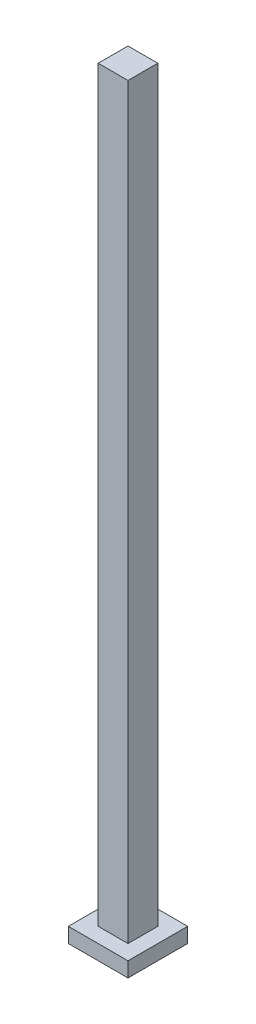
ISO-10303-21;
HEADER;
FILE_DESCRIPTION(('STEP AP214'),'2;1');
FILE_NAME('part.step','',(''),(''),'','','');
FILE_SCHEMA(('AUTOMOTIVE_DESIGN { 1 0 10303 214 1 1 1 1 }'));
ENDSEC;
DATA;
#1=APPLICATION_CONTEXT('core data for automotive mechanical design processes');
#2=APPLICATION_PROTOCOL_DEFINITION('international standard','automotive_design',2000,#1);
#3=PRODUCT_CONTEXT('',#1,'mechanical');
#4=PRODUCT('Part','Part','',(#3));
#5=PRODUCT_RELATED_PRODUCT_CATEGORY('part','',(#4));
#6=PRODUCT_DEFINITION_FORMATION('','',#4);
#7=PRODUCT_DEFINITION_CONTEXT('part definition',#1,'design');
#8=PRODUCT_DEFINITION('design','',#6,#7);
#9=PRODUCT_DEFINITION_SHAPE('','',#8);
#10=(LENGTH_UNIT() NAMED_UNIT(*) SI_UNIT(.MILLI.,.METRE.));
#11=(NAMED_UNIT(*) PLANE_ANGLE_UNIT() SI_UNIT($,.RADIAN.));
#12=(NAMED_UNIT(*) SI_UNIT($,.STERADIAN.) SOLID_ANGLE_UNIT());
#13=UNCERTAINTY_MEASURE_WITH_UNIT(LENGTH_MEASURE(1.E-05),#10,'distance_accuracy_value','');
#14=(GEOMETRIC_REPRESENTATION_CONTEXT(3) GLOBAL_UNCERTAINTY_ASSIGNED_CONTEXT((#13)) GLOBAL_UNIT_ASSIGNED_CONTEXT((#10,
#11,#12)) REPRESENTATION_CONTEXT('',''));
#15=CARTESIAN_POINT('',(0.,0.,0.));
#16=DIRECTION('',(0.,0.,1.));
#17=DIRECTION('',(1.,0.,0.));
#18=AXIS2_PLACEMENT_3D('',#15,#16,#17);
#19=CARTESIAN_POINT('',(100.,50.,100.));
#20=DIRECTION('',(0.,-1.,0.));
#21=DIRECTION('',(1.,0.,0.));
#22=AXIS2_PLACEMENT_3D('',#19,#20,#21);
#23=PLANE('',#22);
#24=DIRECTION('',(-1.,0.,0.));
#25=VECTOR('',#24,1.);
#26=CARTESIAN_POINT('',(100.,50.,-100.));
#27=LINE('',#26,#25);
#28=CARTESIAN_POINT('',(100.,50.,-100.));
#29=VERTEX_POINT('',#28);
#30=CARTESIAN_POINT('',(-100.,50.,-100.));
#31=VERTEX_POINT('',#30);
#32=EDGE_CURVE('E245',#29,#31,#27,.T.);
#33=ORIENTED_EDGE('',*,*,#32,.T.);
#34=DIRECTION('',(0.,0.,-1.));
#35=VECTOR('',#34,1.);
#36=CARTESIAN_POINT('',(-100.,50.,100.));
#37=LINE('',#36,#35);
#38=CARTESIAN_POINT('',(-100.,50.,100.));
#39=VERTEX_POINT('',#38);
#40=EDGE_CURVE('E253',#39,#31,#37,.T.);
#41=ORIENTED_EDGE('',*,*,#40,.F.);
#42=DIRECTION('',(-1.,0.,0.));
#43=VECTOR('',#42,1.);
#44=CARTESIAN_POINT('',(100.,50.,100.));
#45=LINE('',#44,#43);
#46=CARTESIAN_POINT('',(100.,50.,100.));
#47=VERTEX_POINT('',#46);
#48=EDGE_CURVE('E234',#47,#39,#45,.T.);
#49=ORIENTED_EDGE('',*,*,#48,.F.);
#50=DIRECTION('',(0.,0.,-1.));
#51=VECTOR('',#50,1.);
#52=CARTESIAN_POINT('',(100.,50.,100.));
#53=LINE('',#52,#51);
#54=EDGE_CURVE('E49',#47,#29,#53,.T.);
#55=ORIENTED_EDGE('',*,*,#54,.T.);
#56=EDGE_LOOP('',(#33,#41,#49,#55));
#57=FACE_BOUND('',#56,.T.);
#58=DIRECTION('',(0.,0.,1.));
#59=VECTOR('',#58,1.);
#60=CARTESIAN_POINT('',(-50.,50.,-50.));
#61=LINE('',#60,#59);
#62=CARTESIAN_POINT('',(-50.,50.,-50.));
#63=VERTEX_POINT('',#62);
#64=CARTESIAN_POINT('',(-50.0000000000003,50.,50.));
#65=VERTEX_POINT('',#64);
#66=EDGE_CURVE('E135',#63,#65,#61,.T.);
#67=ORIENTED_EDGE('',*,*,#66,.F.);
#68=DIRECTION('',(-1.,0.,0.));
#69=VECTOR('',#68,1.);
#70=CARTESIAN_POINT('',(-50.,50.,-50.));
#71=LINE('',#70,#69);
#72=CARTESIAN_POINT('',(50.,50.,-50.));
#73=VERTEX_POINT('',#72);
#74=EDGE_CURVE('E214',#73,#63,#71,.T.);
#75=ORIENTED_EDGE('',*,*,#74,.F.);
#76=DIRECTION('',(0.,0.,-1.));
#77=VECTOR('',#76,1.);
#78=CARTESIAN_POINT('',(50.,50.,-50.));
#79=LINE('',#78,#77);
#80=CARTESIAN_POINT('',(50.,50.,50.));
#81=VERTEX_POINT('',#80);
#82=EDGE_CURVE('E61',#81,#73,#79,.T.);
#83=ORIENTED_EDGE('',*,*,#82,.F.);
#84=DIRECTION('',(1.,0.,0.));
#85=VECTOR('',#84,1.);
#86=CARTESIAN_POINT('',(-50.,50.,50.));
#87=LINE('',#86,#85);
#88=EDGE_CURVE('E56',#65,#81,#87,.T.);
#89=ORIENTED_EDGE('',*,*,#88,.F.);
#90=EDGE_LOOP('',(#67,#75,#83,#89));
#91=FACE_BOUND('',#90,.T.);
#92=ADVANCED_FACE('F39',(#57,#91),#23,.F.);
#93=CARTESIAN_POINT('',(0.,0.,100.));
#94=DIRECTION('',(0.,1.,0.));
#95=DIRECTION('',(0.,0.,1.));
#96=AXIS2_PLACEMENT_3D('',#93,#94,#95);
#97=PLANE('',#96);
#98=DIRECTION('',(1.,0.,0.));
#99=VECTOR('',#98,1.);
#100=CARTESIAN_POINT('',(0.,0.,-100.));
#101=LINE('',#100,#99);
#102=CARTESIAN_POINT('',(-100.,0.,-100.));
#103=VERTEX_POINT('',#102);
#104=CARTESIAN_POINT('',(100.,0.,-100.));
#105=VERTEX_POINT('',#104);
#106=EDGE_CURVE('E138',#103,#105,#101,.T.);
#107=ORIENTED_EDGE('',*,*,#106,.T.);
#108=DIRECTION('',(0.,0.,-1.));
#109=VECTOR('',#108,1.);
#110=CARTESIAN_POINT('',(100.,0.,100.));
#111=LINE('',#110,#109);
#112=CARTESIAN_POINT('',(100.,0.,100.));
#113=VERTEX_POINT('',#112);
#114=EDGE_CURVE('E11',#113,#105,#111,.T.);
#115=ORIENTED_EDGE('',*,*,#114,.F.);
#116=DIRECTION('',(1.,0.,0.));
#117=VECTOR('',#116,1.);
#118=CARTESIAN_POINT('',(-100.,0.,100.));
#119=LINE('',#118,#117);
#120=CARTESIAN_POINT('',(-100.,0.,100.));
#121=VERTEX_POINT('',#120);
#122=EDGE_CURVE('E227',#121,#113,#119,.T.);
#123=ORIENTED_EDGE('',*,*,#122,.F.);
#124=DIRECTION('',(0.,0.,-1.));
#125=VECTOR('',#124,1.);
#126=CARTESIAN_POINT('',(-100.,0.,100.));
#127=LINE('',#126,#125);
#128=EDGE_CURVE('E240',#121,#103,#127,.T.);
#129=ORIENTED_EDGE('',*,*,#128,.T.);
#130=EDGE_LOOP('',(#107,#115,#123,#129));
#131=FACE_BOUND('',#130,.T.);
#132=ADVANCED_FACE('F41',(#131),#97,.F.);
#133=CARTESIAN_POINT('',(100.,0.,100.));
#134=DIRECTION('',(-1.,0.,0.));
#135=DIRECTION('',(0.,0.,1.));
#136=AXIS2_PLACEMENT_3D('',#133,#134,#135);
#137=PLANE('',#136);
#138=DIRECTION('',(0.,1.,0.));
#139=VECTOR('',#138,1.);
#140=CARTESIAN_POINT('',(100.,0.,-100.));
#141=LINE('',#140,#139);
#142=EDGE_CURVE('E243',#105,#29,#141,.T.);
#143=ORIENTED_EDGE('',*,*,#142,.T.);
#144=ORIENTED_EDGE('',*,*,#54,.F.);
#145=DIRECTION('',(0.,1.,0.));
#146=VECTOR('',#145,1.);
#147=CARTESIAN_POINT('',(100.,0.,100.));
#148=LINE('',#147,#146);
#149=EDGE_CURVE('E230',#113,#47,#148,.T.);
#150=ORIENTED_EDGE('',*,*,#149,.F.);
#151=ORIENTED_EDGE('',*,*,#114,.T.);
#152=EDGE_LOOP('',(#143,#144,#150,#151));
#153=FACE_BOUND('',#152,.T.);
#154=ADVANCED_FACE('F278',(#153),#137,.F.);
#155=CARTESIAN_POINT('',(-100.,50.,100.));
#156=DIRECTION('',(1.,0.,0.));
#157=DIRECTION('',(0.,0.,-1.));
#158=AXIS2_PLACEMENT_3D('',#155,#156,#157);
#159=PLANE('',#158);
#160=DIRECTION('',(0.,-1.,0.));
#161=VECTOR('',#160,1.);
#162=CARTESIAN_POINT('',(-100.,50.,-100.));
#163=LINE('',#162,#161);
#164=EDGE_CURVE('E231',#31,#103,#163,.T.);
#165=ORIENTED_EDGE('',*,*,#164,.T.);
#166=ORIENTED_EDGE('',*,*,#128,.F.);
#167=DIRECTION('',(0.,-1.,0.));
#168=VECTOR('',#167,1.);
#169=CARTESIAN_POINT('',(-100.,50.,100.));
#170=LINE('',#169,#168);
#171=EDGE_CURVE('E237',#39,#121,#170,.T.);
#172=ORIENTED_EDGE('',*,*,#171,.F.);
#173=ORIENTED_EDGE('',*,*,#40,.T.);
#174=EDGE_LOOP('',(#165,#166,#172,#173));
#175=FACE_BOUND('',#174,.T.);
#176=ADVANCED_FACE('F271',(#175),#159,.F.);
#177=CARTESIAN_POINT('',(0.,0.,100.));
#178=DIRECTION('',(0.,0.,1.));
#179=DIRECTION('',(1.,0.,0.));
#180=AXIS2_PLACEMENT_3D('',#177,#178,#179);
#181=PLANE('',#180);
#182=ORIENTED_EDGE('',*,*,#122,.T.);
#183=ORIENTED_EDGE('',*,*,#149,.T.);
#184=ORIENTED_EDGE('',*,*,#48,.T.);
#185=ORIENTED_EDGE('',*,*,#171,.T.);
#186=EDGE_LOOP('',(#182,#183,#184,#185));
#187=FACE_BOUND('',#186,.T.);
#188=ADVANCED_FACE('F277',(#187),#181,.T.);
#189=CARTESIAN_POINT('',(0.,0.,-100.));
#190=DIRECTION('',(0.,0.,1.));
#191=DIRECTION('',(1.,0.,0.));
#192=AXIS2_PLACEMENT_3D('',#189,#190,#191);
#193=PLANE('',#192);
#194=ORIENTED_EDGE('',*,*,#106,.F.);
#195=ORIENTED_EDGE('',*,*,#164,.F.);
#196=ORIENTED_EDGE('',*,*,#32,.F.);
#197=ORIENTED_EDGE('',*,*,#142,.F.);
#198=EDGE_LOOP('',(#194,#195,#196,#197));
#199=FACE_BOUND('',#198,.T.);
#200=ADVANCED_FACE('F268',(#199),#193,.F.);
#201=CARTESIAN_POINT('',(-50.0000000000004,2550.,-50.));
#202=DIRECTION('',(1.,0.,0.));
#203=DIRECTION('',(0.,1.,0.));
#204=AXIS2_PLACEMENT_3D('',#201,#202,#203);
#205=PLANE('',#204);
#206=ORIENTED_EDGE('',*,*,#66,.T.);
#207=DIRECTION('',(0.,-1.,0.));
#208=VECTOR('',#207,1.);
#209=CARTESIAN_POINT('',(-50.0000000000004,2550.,50.));
#210=LINE('',#209,#208);
#211=CARTESIAN_POINT('',(-50.0000000000004,2555.,50.));
#212=VERTEX_POINT('',#211);
#213=EDGE_CURVE('E128',#212,#65,#210,.T.);
#214=ORIENTED_EDGE('',*,*,#213,.F.);
#215=DIRECTION('',(0.,0.,1.));
#216=VECTOR('',#215,1.);
#217=CARTESIAN_POINT('',(-50.0000000000004,2555.,-50.));
#218=LINE('',#217,#216);
#219=CARTESIAN_POINT('',(-50.0000000000004,2555.,-50.));
#220=VERTEX_POINT('',#219);
#221=EDGE_CURVE('E133',#220,#212,#218,.T.);
#222=ORIENTED_EDGE('',*,*,#221,.F.);
#223=DIRECTION('',(0.,-1.,0.));
#224=VECTOR('',#223,1.);
#225=CARTESIAN_POINT('',(-50.0000000000004,2550.,-50.));
#226=LINE('',#225,#224);
#227=EDGE_CURVE('E218',#220,#63,#226,.T.);
#228=ORIENTED_EDGE('',*,*,#227,.T.);
#229=EDGE_LOOP('',(#206,#214,#222,#228));
#230=FACE_BOUND('',#229,.T.);
#231=ADVANCED_FACE('F130',(#230),#205,.F.);
#232=CARTESIAN_POINT('',(-50.0000000000004,2550.,50.));
#233=DIRECTION('',(0.,0.,-1.));
#234=DIRECTION('',(-1.,0.,0.));
#235=AXIS2_PLACEMENT_3D('',#232,#233,#234);
#236=PLANE('',#235);
#237=ORIENTED_EDGE('',*,*,#88,.T.);
#238=DIRECTION('',(0.,-1.,0.));
#239=VECTOR('',#238,1.);
#240=CARTESIAN_POINT('',(49.9999999999997,2550.,50.));
#241=LINE('',#240,#239);
#242=CARTESIAN_POINT('',(49.9999999999997,2555.,50.));
#243=VERTEX_POINT('',#242);
#244=EDGE_CURVE('E139',#243,#81,#241,.T.);
#245=ORIENTED_EDGE('',*,*,#244,.F.);
#246=DIRECTION('',(1.,0.,0.));
#247=VECTOR('',#246,1.);
#248=CARTESIAN_POINT('',(-50.0000000000004,2555.,50.));
#249=LINE('',#248,#247);
#250=EDGE_CURVE('E142',#212,#243,#249,.T.);
#251=ORIENTED_EDGE('',*,*,#250,.F.);
#252=ORIENTED_EDGE('',*,*,#213,.T.);
#253=EDGE_LOOP('',(#237,#245,#251,#252));
#254=FACE_BOUND('',#253,.T.);
#255=ADVANCED_FACE('F143',(#254),#236,.F.);
#256=CARTESIAN_POINT('',(49.9999999999996,2550.,-50.));
#257=DIRECTION('',(-1.,0.,0.));
#258=DIRECTION('',(0.,0.,1.));
#259=AXIS2_PLACEMENT_3D('',#256,#257,#258);
#260=PLANE('',#259);
#261=ORIENTED_EDGE('',*,*,#82,.T.);
#262=DIRECTION('',(0.,-1.,0.));
#263=VECTOR('',#262,1.);
#264=CARTESIAN_POINT('',(49.9999999999996,2550.,-50.));
#265=LINE('',#264,#263);
#266=CARTESIAN_POINT('',(49.9999999999997,2555.,-50.));
#267=VERTEX_POINT('',#266);
#268=EDGE_CURVE('E221',#267,#73,#265,.T.);
#269=ORIENTED_EDGE('',*,*,#268,.F.);
#270=DIRECTION('',(0.,0.,1.));
#271=VECTOR('',#270,1.);
#272=CARTESIAN_POINT('',(49.9999999999997,2555.,-50.));
#273=LINE('',#272,#271);
#274=EDGE_CURVE('E149',#267,#243,#273,.T.);
#275=ORIENTED_EDGE('',*,*,#274,.T.);
#276=ORIENTED_EDGE('',*,*,#244,.T.);
#277=EDGE_LOOP('',(#261,#269,#275,#276));
#278=FACE_BOUND('',#277,.T.);
#279=ADVANCED_FACE('F330',(#278),#260,.F.);
#280=CARTESIAN_POINT('',(-50.0000000000004,2550.,-50.));
#281=DIRECTION('',(0.,0.,1.));
#282=DIRECTION('',(1.,0.,0.));
#283=AXIS2_PLACEMENT_3D('',#280,#281,#282);
#284=PLANE('',#283);
#285=ORIENTED_EDGE('',*,*,#74,.T.);
#286=ORIENTED_EDGE('',*,*,#227,.F.);
#287=DIRECTION('',(1.,0.,0.));
#288=VECTOR('',#287,1.);
#289=CARTESIAN_POINT('',(-50.0000000000004,2555.,-50.));
#290=LINE('',#289,#288);
#291=EDGE_CURVE('E153',#220,#267,#290,.T.);
#292=ORIENTED_EDGE('',*,*,#291,.T.);
#293=ORIENTED_EDGE('',*,*,#268,.T.);
#294=EDGE_LOOP('',(#285,#286,#292,#293));
#295=FACE_BOUND('',#294,.T.);
#296=ADVANCED_FACE('F327',(#295),#284,.F.);
#297=CARTESIAN_POINT('',(0.,2555.,0.));
#298=DIRECTION('',(0.,1.,0.));
#299=DIRECTION('',(0.,0.,1.));
#300=AXIS2_PLACEMENT_3D('',#297,#298,#299);
#301=PLANE('',#300);
#302=ORIENTED_EDGE('',*,*,#221,.T.);
#303=ORIENTED_EDGE('',*,*,#250,.T.);
#304=ORIENTED_EDGE('',*,*,#274,.F.);
#305=ORIENTED_EDGE('',*,*,#291,.F.);
#306=EDGE_LOOP('',(#302,#303,#304,#305));
#307=FACE_BOUND('',#306,.T.);
#308=ADVANCED_FACE('F151',(#307),#301,.T.);
#309=CLOSED_SHELL('',(#92,#132,#154,#176,#188,#200,#231,#255,#279,#296,#308));
#310=DIRECTION('',(-1.,0.,0.));
#311=VECTOR('',#310,1.);
#312=CARTESIAN_POINT('',(-45.2726750226584,50.,-44.5989745014881));
#313=LINE('',#312,#311);
#314=CARTESIAN_POINT('',(44.7273249773416,50.,-44.5989745014881));
#315=VERTEX_POINT('',#314);
#316=CARTESIAN_POINT('',(-45.2726750226588,50.,-44.5989745014881));
#317=VERTEX_POINT('',#316);
#318=EDGE_CURVE('E169',#315,#317,#313,.T.);
#319=ORIENTED_EDGE('',*,*,#318,.T.);
#320=DIRECTION('',(0.,0.,1.));
#321=VECTOR('',#320,1.);
#322=CARTESIAN_POINT('',(-45.2726750226584,50.,-44.5989745014881));
#323=LINE('',#322,#321);
#324=CARTESIAN_POINT('',(-45.2726750226584,50.,45.4010254985119));
#325=VERTEX_POINT('',#324);
#326=EDGE_CURVE('E163',#317,#325,#323,.T.);
#327=ORIENTED_EDGE('',*,*,#326,.T.);
#328=DIRECTION('',(1.,0.,0.));
#329=VECTOR('',#328,1.);
#330=CARTESIAN_POINT('',(-45.2726750226584,50.,45.4010254985119));
#331=LINE('',#330,#329);
#332=CARTESIAN_POINT('',(44.7273249773416,50.,45.4010254985119));
#333=VERTEX_POINT('',#332);
#334=EDGE_CURVE('E185',#325,#333,#331,.T.);
#335=ORIENTED_EDGE('',*,*,#334,.T.);
#336=DIRECTION('',(0.,0.,-1.));
#337=VECTOR('',#336,1.);
#338=CARTESIAN_POINT('',(44.7273249773416,50.,-44.5989745014881));
#339=LINE('',#338,#337);
#340=EDGE_CURVE('E189',#333,#315,#339,.T.);
#341=ORIENTED_EDGE('',*,*,#340,.T.);
#342=EDGE_LOOP('',(#319,#327,#335,#341));
#343=FACE_BOUND('',#342,.T.);
#344=ADVANCED_FACE('F287',(#343),#23,.F.);
#345=CARTESIAN_POINT('',(44.7273249773412,2550.,-44.5989745014881));
#346=DIRECTION('',(-1.,0.,0.));
#347=DIRECTION('',(0.,0.,1.));
#348=AXIS2_PLACEMENT_3D('',#345,#346,#347);
#349=PLANE('',#348);
#350=ORIENTED_EDGE('',*,*,#340,.F.);
#351=DIRECTION('',(0.,-1.,0.));
#352=VECTOR('',#351,1.);
#353=CARTESIAN_POINT('',(44.7273249773412,2550.,45.4010254985119));
#354=LINE('',#353,#352);
#355=CARTESIAN_POINT('',(44.7273249773412,2550.,45.4010254985119));
#356=VERTEX_POINT('',#355);
#357=EDGE_CURVE('E201',#356,#333,#354,.T.);
#358=ORIENTED_EDGE('',*,*,#357,.F.);
#359=DIRECTION('',(0.,0.,-1.));
#360=VECTOR('',#359,1.);
#361=CARTESIAN_POINT('',(44.7273249773412,2550.,-44.5989745014881));
#362=LINE('',#361,#360);
#363=CARTESIAN_POINT('',(44.7273249773416,2550.,-44.5989745014881));
#364=VERTEX_POINT('',#363);
#365=EDGE_CURVE('E173',#356,#364,#362,.T.);
#366=ORIENTED_EDGE('',*,*,#365,.T.);
#367=DIRECTION('',(0.,-1.,0.));
#368=VECTOR('',#367,1.);
#369=CARTESIAN_POINT('',(44.7273249773412,2550.,-44.5989745014881));
#370=LINE('',#369,#368);
#371=EDGE_CURVE('E198',#364,#315,#370,.T.);
#372=ORIENTED_EDGE('',*,*,#371,.T.);
#373=EDGE_LOOP('',(#350,#358,#366,#372));
#374=FACE_BOUND('',#373,.T.);
#375=ADVANCED_FACE('F291',(#374),#349,.T.);
#376=CARTESIAN_POINT('',(-45.2726750226588,2550.,-44.5989745014881));
#377=DIRECTION('',(0.,0.,1.));
#378=DIRECTION('',(1.,0.,0.));
#379=AXIS2_PLACEMENT_3D('',#376,#377,#378);
#380=PLANE('',#379);
#381=ORIENTED_EDGE('',*,*,#318,.F.);
#382=ORIENTED_EDGE('',*,*,#371,.F.);
#383=DIRECTION('',(-1.,0.,0.));
#384=VECTOR('',#383,1.);
#385=CARTESIAN_POINT('',(-45.2726750226588,2550.,-44.5989745014881));
#386=LINE('',#385,#384);
#387=CARTESIAN_POINT('',(-45.2726750226588,2550.,-44.5989745014881));
#388=VERTEX_POINT('',#387);
#389=EDGE_CURVE('E177',#364,#388,#386,.T.);
#390=ORIENTED_EDGE('',*,*,#389,.T.);
#391=DIRECTION('',(0.,-1.,0.));
#392=VECTOR('',#391,1.);
#393=CARTESIAN_POINT('',(-45.2726750226588,2550.,-44.5989745014881));
#394=LINE('',#393,#392);
#395=EDGE_CURVE('E181',#388,#317,#394,.T.);
#396=ORIENTED_EDGE('',*,*,#395,.T.);
#397=EDGE_LOOP('',(#381,#382,#390,#396));
#398=FACE_BOUND('',#397,.T.);
#399=ADVANCED_FACE('F298',(#398),#380,.T.);
#400=CARTESIAN_POINT('',(-45.2726750226588,2550.,-44.5989745014881));
#401=DIRECTION('',(1.,0.,0.));
#402=DIRECTION('',(0.,0.,-1.));
#403=AXIS2_PLACEMENT_3D('',#400,#401,#402);
#404=PLANE('',#403);
#405=ORIENTED_EDGE('',*,*,#326,.F.);
#406=ORIENTED_EDGE('',*,*,#395,.F.);
#407=DIRECTION('',(0.,0.,1.));
#408=VECTOR('',#407,1.);
#409=CARTESIAN_POINT('',(-45.2726750226588,2550.,-44.5989745014881));
#410=LINE('',#409,#408);
#411=CARTESIAN_POINT('',(-45.2726750226588,2550.,45.4010254985119));
#412=VERTEX_POINT('',#411);
#413=EDGE_CURVE('E164',#388,#412,#410,.T.);
#414=ORIENTED_EDGE('',*,*,#413,.T.);
#415=DIRECTION('',(0.,-1.,0.));
#416=VECTOR('',#415,1.);
#417=CARTESIAN_POINT('',(-45.2726750226588,2550.,45.4010254985119));
#418=LINE('',#417,#416);
#419=EDGE_CURVE('E204',#412,#325,#418,.T.);
#420=ORIENTED_EDGE('',*,*,#419,.T.);
#421=EDGE_LOOP('',(#405,#406,#414,#420));
#422=FACE_BOUND('',#421,.T.);
#423=ADVANCED_FACE('F308',(#422),#404,.T.);
#424=CARTESIAN_POINT('',(-45.2726750226588,2550.,45.4010254985119));
#425=DIRECTION('',(0.,0.,-1.));
#426=DIRECTION('',(-1.,0.,0.));
#427=AXIS2_PLACEMENT_3D('',#424,#425,#426);
#428=PLANE('',#427);
#429=ORIENTED_EDGE('',*,*,#334,.F.);
#430=ORIENTED_EDGE('',*,*,#419,.F.);
#431=DIRECTION('',(1.,0.,0.));
#432=VECTOR('',#431,1.);
#433=CARTESIAN_POINT('',(-45.2726750226588,2550.,45.4010254985119));
#434=LINE('',#433,#432);
#435=EDGE_CURVE('E168',#412,#356,#434,.T.);
#436=ORIENTED_EDGE('',*,*,#435,.T.);
#437=ORIENTED_EDGE('',*,*,#357,.T.);
#438=EDGE_LOOP('',(#429,#430,#436,#437));
#439=FACE_BOUND('',#438,.T.);
#440=ADVANCED_FACE('F311',(#439),#428,.T.);
#441=CARTESIAN_POINT('',(0.,2550.,0.));
#442=DIRECTION('',(0.,1.,0.));
#443=DIRECTION('',(0.,0.,1.));
#444=AXIS2_PLACEMENT_3D('',#441,#442,#443);
#445=PLANE('',#444);
#446=ORIENTED_EDGE('',*,*,#435,.F.);
#447=ORIENTED_EDGE('',*,*,#413,.F.);
#448=ORIENTED_EDGE('',*,*,#389,.F.);
#449=ORIENTED_EDGE('',*,*,#365,.F.);
#450=EDGE_LOOP('',(#446,#447,#448,#449));
#451=FACE_BOUND('',#450,.T.);
#452=ADVANCED_FACE('F314',(#451),#445,.F.);
#453=CLOSED_SHELL('',(#344,#375,#399,#423,#440,#452));
#454=ORIENTED_CLOSED_SHELL('',*,#453,.T.);
#455=BREP_WITH_VOIDS('B2',#309,(#454));
#456=ADVANCED_BREP_SHAPE_REPRESENTATION('',(#18,#455),#14);
#457=SHAPE_DEFINITION_REPRESENTATION(#9,#456);
ENDSEC;
END-ISO-10303-21;
